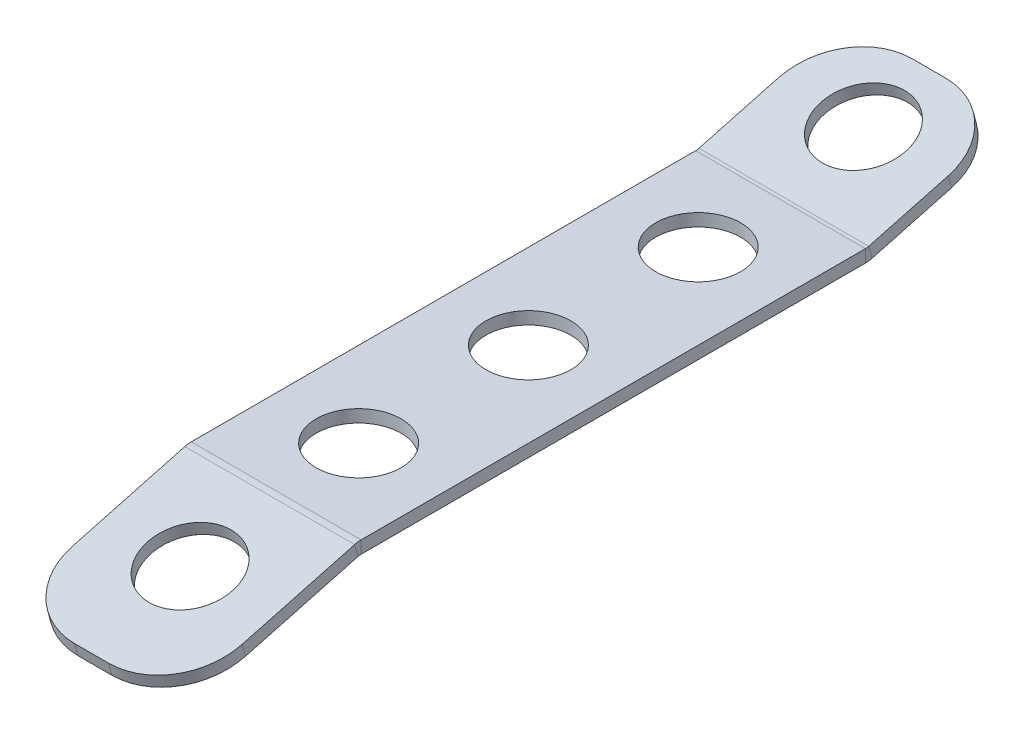
ISO-10303-21;
HEADER;
FILE_DESCRIPTION(('STEP AP214'),'2;1');
FILE_NAME('part.step','',(''),(''),'','','');
FILE_SCHEMA(('AUTOMOTIVE_DESIGN { 1 0 10303 214 1 1 1 1 }'));
ENDSEC;
DATA;
#1=APPLICATION_CONTEXT('core data for automotive mechanical design processes');
#2=APPLICATION_PROTOCOL_DEFINITION('international standard','automotive_design',2000,#1);
#3=PRODUCT_CONTEXT('',#1,'mechanical');
#4=PRODUCT('Part','Part','',(#3));
#5=PRODUCT_RELATED_PRODUCT_CATEGORY('part','',(#4));
#6=PRODUCT_DEFINITION_FORMATION('','',#4);
#7=PRODUCT_DEFINITION_CONTEXT('part definition',#1,'design');
#8=PRODUCT_DEFINITION('design','',#6,#7);
#9=PRODUCT_DEFINITION_SHAPE('','',#8);
#10=(LENGTH_UNIT() NAMED_UNIT(*) SI_UNIT(.MILLI.,.METRE.));
#11=(NAMED_UNIT(*) PLANE_ANGLE_UNIT() SI_UNIT($,.RADIAN.));
#12=(NAMED_UNIT(*) SI_UNIT($,.STERADIAN.) SOLID_ANGLE_UNIT());
#13=UNCERTAINTY_MEASURE_WITH_UNIT(LENGTH_MEASURE(1.E-05),#10,'distance_accuracy_value','');
#14=(GEOMETRIC_REPRESENTATION_CONTEXT(3) GLOBAL_UNCERTAINTY_ASSIGNED_CONTEXT((#13)) GLOBAL_UNIT_ASSIGNED_CONTEXT((#10,
#11,#12)) REPRESENTATION_CONTEXT('',''));
#15=CARTESIAN_POINT('',(0.,0.,0.));
#16=DIRECTION('',(0.,0.,1.));
#17=DIRECTION('',(1.,0.,0.));
#18=AXIS2_PLACEMENT_3D('',#15,#16,#17);
#19=CARTESIAN_POINT('',(0.,0.,0.));
#20=DIRECTION('',(0.,-1.,0.));
#21=DIRECTION('',(0.,0.,-1.));
#22=AXIS2_PLACEMENT_3D('',#19,#20,#21);
#23=PLANE('',#22);
#24=CARTESIAN_POINT('',(0.,0.,9.));
#25=DIRECTION('',(0.,1.,0.));
#26=DIRECTION('',(0.,0.,1.));
#27=AXIS2_PLACEMENT_3D('',#24,#25,#26);
#28=CIRCLE('',#27,2.5);
#29=CARTESIAN_POINT('',(0.,0.,11.5));
#30=VERTEX_POINT('',#29);
#31=EDGE_CURVE('E267',#30,#30,#28,.T.);
#32=ORIENTED_EDGE('',*,*,#31,.F.);
#33=EDGE_LOOP('',(#32));
#34=FACE_BOUND('',#33,.T.);
#35=CARTESIAN_POINT('',(0.,0.,-0.999999999999997));
#36=DIRECTION('',(0.,1.,0.));
#37=DIRECTION('',(0.,0.,1.));
#38=AXIS2_PLACEMENT_3D('',#35,#36,#37);
#39=CIRCLE('',#38,2.5);
#40=CARTESIAN_POINT('',(0.,0.,1.5));
#41=VERTEX_POINT('',#40);
#42=EDGE_CURVE('E270',#41,#41,#39,.T.);
#43=ORIENTED_EDGE('',*,*,#42,.F.);
#44=EDGE_LOOP('',(#43));
#45=FACE_BOUND('',#44,.T.);
#46=CARTESIAN_POINT('',(-1.04744440165294E-13,0.,-11.));
#47=DIRECTION('',(0.,1.,0.));
#48=DIRECTION('',(0.,0.,1.));
#49=AXIS2_PLACEMENT_3D('',#46,#47,#48);
#50=CIRCLE('',#49,2.5);
#51=CARTESIAN_POINT('',(-1.04744440165294E-13,0.,-8.49999999999999));
#52=VERTEX_POINT('',#51);
#53=EDGE_CURVE('E273',#52,#52,#50,.T.);
#54=ORIENTED_EDGE('',*,*,#53,.F.);
#55=EDGE_LOOP('',(#54));
#56=FACE_BOUND('',#55,.T.);
#57=DIRECTION('',(0.,0.,1.));
#58=VECTOR('',#57,1.);
#59=CARTESIAN_POINT('',(-5.,0.,25.));
#60=LINE('',#59,#58);
#61=CARTESIAN_POINT('',(-5.,0.,-15.8553689282104));
#62=VERTEX_POINT('',#61);
#63=CARTESIAN_POINT('',(-5.,0.,13.8553689282104));
#64=VERTEX_POINT('',#63);
#65=EDGE_CURVE('E62',#62,#64,#60,.T.);
#66=ORIENTED_EDGE('',*,*,#65,.T.);
#67=DIRECTION('',(1.,0.,0.));
#68=VECTOR('',#67,1.);
#69=CARTESIAN_POINT('',(0.,0.,13.8553689282104));
#70=LINE('',#69,#68);
#71=CARTESIAN_POINT('',(5.,0.,13.8553689282104));
#72=VERTEX_POINT('',#71);
#73=EDGE_CURVE('E54',#64,#72,#70,.T.);
#74=ORIENTED_EDGE('',*,*,#73,.T.);
#75=DIRECTION('',(0.,0.,-1.));
#76=VECTOR('',#75,1.);
#77=CARTESIAN_POINT('',(5.,0.,25.));
#78=LINE('',#77,#76);
#79=CARTESIAN_POINT('',(5.,0.,-15.8553689282104));
#80=VERTEX_POINT('',#79);
#81=EDGE_CURVE('E70',#72,#80,#78,.T.);
#82=ORIENTED_EDGE('',*,*,#81,.T.);
#83=DIRECTION('',(1.,0.,0.));
#84=VECTOR('',#83,1.);
#85=CARTESIAN_POINT('',(0.,0.,-15.8553689282104));
#86=LINE('',#85,#84);
#87=EDGE_CURVE('E244',#62,#80,#86,.T.);
#88=ORIENTED_EDGE('',*,*,#87,.F.);
#89=EDGE_LOOP('',(#66,#74,#82,#88));
#90=FACE_BOUND('',#89,.T.);
#91=ADVANCED_FACE('F45',(#34,#45,#56,#90),#23,.F.);
#92=CARTESIAN_POINT('',(0.,-4.15343896117762,-0.451498928682303));
#93=DIRECTION('',(0.,-0.965925826289068,-0.258819045102521));
#94=DIRECTION('',(0.,0.258819045102521,-0.965925826289068));
#95=AXIS2_PLACEMENT_3D('',#92,#93,#94);
#96=PLANE('',#95);
#97=CARTESIAN_POINT('',(-1.39162735693614E-13,1.28176098597533,-20.7359412807527));
#98=DIRECTION('',(0.,0.965925826289068,0.258819045102521));
#99=DIRECTION('',(0.,-0.258819045102521,0.965925826289068));
#100=AXIS2_PLACEMENT_3D('',#97,#98,#99);
#101=CIRCLE('',#100,2.5);
#102=CARTESIAN_POINT('',(-1.39221844962675E-13,0.634713373219027,-18.3211267150301));
#103=VERTEX_POINT('',#102);
#104=EDGE_CURVE('E282',#103,#103,#101,.T.);
#105=ORIENTED_EDGE('',*,*,#104,.F.);
#106=EDGE_LOOP('',(#105));
#107=FACE_BOUND('',#106,.T.);
#108=DIRECTION('',(0.,-0.258819045102521,0.965925826289068));
#109=VECTOR('',#108,1.);
#110=CARTESIAN_POINT('',(-5.,-10.6239150887407,23.6966467285444));
#111=LINE('',#110,#109);
#112=CARTESIAN_POINT('',(-5.,1.28176098597533,-20.7359412807527));
#113=VERTEX_POINT('',#112);
#114=CARTESIAN_POINT('',(-5.,0.025099036355474,-16.0460150368329));
#115=VERTEX_POINT('',#114);
#116=EDGE_CURVE('E293',#113,#115,#111,.T.);
#117=ORIENTED_EDGE('',*,*,#116,.T.);
#118=DIRECTION('',(1.,0.,0.));
#119=VECTOR('',#118,1.);
#120=CARTESIAN_POINT('',(0.,0.0250990363554731,-16.0460150368329));
#121=LINE('',#120,#119);
#122=CARTESIAN_POINT('',(5.,0.0250990363554722,-16.0460150368329));
#123=VERTEX_POINT('',#122);
#124=EDGE_CURVE('E319',#115,#123,#121,.T.);
#125=ORIENTED_EDGE('',*,*,#124,.T.);
#126=DIRECTION('',(0.,0.258819045102521,-0.965925826289068));
#127=VECTOR('',#126,1.);
#128=CARTESIAN_POINT('',(5.,-10.6239150887407,23.6966467285444));
#129=LINE('',#128,#127);
#130=CARTESIAN_POINT('',(5.,1.28176098597533,-20.7359412807527));
#131=VERTEX_POINT('',#130);
#132=EDGE_CURVE('E281',#123,#131,#129,.T.);
#133=ORIENTED_EDGE('',*,*,#132,.T.);
#134=CARTESIAN_POINT('',(1.,1.28176098597533,-20.7359412807527));
#135=DIRECTION('',(0.,-0.965925826289068,-0.258819045102521));
#136=DIRECTION('',(0.,0.258819045102521,-0.965925826289068));
#137=AXIS2_PLACEMENT_3D('',#134,#135,#136);
#138=CIRCLE('',#137,4.);
#139=CARTESIAN_POINT('',(1.,2.31703716638542,-24.599644585909));
#140=VERTEX_POINT('',#139);
#141=EDGE_CURVE('E298',#131,#140,#138,.F.);
#142=ORIENTED_EDGE('',*,*,#141,.T.);
#143=DIRECTION('',(-1.,0.,0.));
#144=VECTOR('',#143,1.);
#145=CARTESIAN_POINT('',(-5.,2.31703716638542,-24.599644585909));
#146=LINE('',#145,#144);
#147=CARTESIAN_POINT('',(-0.999999999999999,2.31703716638542,-24.599644585909));
#148=VERTEX_POINT('',#147);
#149=EDGE_CURVE('E290',#140,#148,#146,.T.);
#150=ORIENTED_EDGE('',*,*,#149,.T.);
#151=CARTESIAN_POINT('',(-0.999999999999999,1.28176098597533,-20.7359412807527));
#152=DIRECTION('',(0.,-0.965925826289068,-0.258819045102521));
#153=DIRECTION('',(0.,0.258819045102521,-0.965925826289068));
#154=AXIS2_PLACEMENT_3D('',#151,#152,#153);
#155=CIRCLE('',#154,4.);
#156=EDGE_CURVE('E296',#148,#113,#155,.F.);
#157=ORIENTED_EDGE('',*,*,#156,.T.);
#158=EDGE_LOOP('',(#117,#125,#133,#142,#150,#157));
#159=FACE_BOUND('',#158,.T.);
#160=ADVANCED_FACE('F366',(#107,#159),#96,.F.);
#161=CARTESIAN_POINT('',(5.,-11.3354160523852,23.5060006199219));
#162=DIRECTION('',(1.,0.,0.));
#163=DIRECTION('',(0.,0.258819045102521,-0.965925826289068));
#164=AXIS2_PLACEMENT_3D('',#161,#162,#163);
#165=PLANE('',#164);
#166=DIRECTION('',(0.,0.965925826289068,0.258819045102521));
#167=VECTOR('',#166,1.);
#168=CARTESIAN_POINT('',(5.,-0.686401927289056,-16.2366611454554));
#169=LINE('',#168,#167);
#170=CARTESIAN_POINT('',(5.,-0.686401927289056,-16.2366611454554));
#171=VERTEX_POINT('',#170);
#172=EDGE_CURVE('E316',#171,#123,#169,.T.);
#173=ORIENTED_EDGE('',*,*,#172,.F.);
#174=DIRECTION('',(0.,0.258819045102521,-0.965925826289068));
#175=VECTOR('',#174,1.);
#176=CARTESIAN_POINT('',(5.,-11.3354160523852,23.5060006199219));
#177=LINE('',#176,#175);
#178=CARTESIAN_POINT('',(5.,0.570260022330802,-20.9265873893752));
#179=VERTEX_POINT('',#178);
#180=EDGE_CURVE('E289',#171,#179,#177,.T.);
#181=ORIENTED_EDGE('',*,*,#180,.T.);
#182=DIRECTION('',(0.,0.965925826289068,0.258819045102521));
#183=VECTOR('',#182,1.);
#184=CARTESIAN_POINT('',(5.,0.570260022330802,-20.9265873893752));
#185=LINE('',#184,#183);
#186=EDGE_CURVE('E305',#179,#131,#185,.T.);
#187=ORIENTED_EDGE('',*,*,#186,.T.);
#188=ORIENTED_EDGE('',*,*,#132,.F.);
#189=EDGE_LOOP('',(#173,#181,#187,#188));
#190=FACE_BOUND('',#189,.T.);
#191=ADVANCED_FACE('F386',(#190),#165,.T.);
#192=CARTESIAN_POINT('',(-5.,-11.3354160523852,23.5060006199219));
#193=DIRECTION('',(-1.,0.,0.));
#194=DIRECTION('',(0.,-0.258819045102521,0.965925826289068));
#195=AXIS2_PLACEMENT_3D('',#192,#193,#194);
#196=PLANE('',#195);
#197=DIRECTION('',(0.,-0.965925826289068,-0.258819045102521));
#198=VECTOR('',#197,1.);
#199=CARTESIAN_POINT('',(-5.,-0.686401927289056,-16.2366611454554));
#200=LINE('',#199,#198);
#201=CARTESIAN_POINT('',(-5.,-0.686401927289053,-16.2366611454554));
#202=VERTEX_POINT('',#201);
#203=EDGE_CURVE('E322',#115,#202,#200,.T.);
#204=ORIENTED_EDGE('',*,*,#203,.F.);
#205=ORIENTED_EDGE('',*,*,#116,.F.);
#206=DIRECTION('',(0.,0.965925826289068,0.258819045102521));
#207=VECTOR('',#206,1.);
#208=CARTESIAN_POINT('',(-5.,0.570260022330803,-20.9265873893752));
#209=LINE('',#208,#207);
#210=CARTESIAN_POINT('',(-5.,0.570260022330803,-20.9265873893752));
#211=VERTEX_POINT('',#210);
#212=EDGE_CURVE('E294',#113,#211,#209,.F.);
#213=ORIENTED_EDGE('',*,*,#212,.T.);
#214=DIRECTION('',(0.,-0.258819045102521,0.965925826289068));
#215=VECTOR('',#214,1.);
#216=CARTESIAN_POINT('',(-5.,-11.3354160523852,23.5060006199219));
#217=LINE('',#216,#215);
#218=EDGE_CURVE('E288',#211,#202,#217,.T.);
#219=ORIENTED_EDGE('',*,*,#218,.T.);
#220=EDGE_LOOP('',(#204,#205,#213,#219));
#221=FACE_BOUND('',#220,.T.);
#222=ADVANCED_FACE('F362',(#221),#196,.T.);
#223=CARTESIAN_POINT('',(-5.,1.60553620274089,-24.7902906945315));
#224=DIRECTION('',(0.,0.258819045102521,-0.965925826289068));
#225=DIRECTION('',(-1.,0.,0.));
#226=AXIS2_PLACEMENT_3D('',#223,#224,#225);
#227=PLANE('',#226);
#228=ORIENTED_EDGE('',*,*,#149,.F.);
#229=DIRECTION('',(0.,0.965925826289068,0.258819045102521));
#230=VECTOR('',#229,1.);
#231=CARTESIAN_POINT('',(1.,1.60553620274089,-24.7902906945315));
#232=LINE('',#231,#230);
#233=CARTESIAN_POINT('',(1.,1.60553620274089,-24.7902906945315));
#234=VERTEX_POINT('',#233);
#235=EDGE_CURVE('E311',#140,#234,#232,.F.);
#236=ORIENTED_EDGE('',*,*,#235,.T.);
#237=DIRECTION('',(-1.,0.,0.));
#238=VECTOR('',#237,1.);
#239=CARTESIAN_POINT('',(-5.,1.60553620274089,-24.7902906945315));
#240=LINE('',#239,#238);
#241=CARTESIAN_POINT('',(-0.999999999999999,1.60553620274089,-24.7902906945315));
#242=VERTEX_POINT('',#241);
#243=EDGE_CURVE('E285',#234,#242,#240,.T.);
#244=ORIENTED_EDGE('',*,*,#243,.T.);
#245=DIRECTION('',(0.,0.965925826289068,0.258819045102521));
#246=VECTOR('',#245,1.);
#247=CARTESIAN_POINT('',(-0.999999999999999,1.60553620274089,-24.7902906945315));
#248=LINE('',#247,#246);
#249=EDGE_CURVE('E308',#242,#148,#248,.T.);
#250=ORIENTED_EDGE('',*,*,#249,.T.);
#251=EDGE_LOOP('',(#228,#236,#244,#250));
#252=FACE_BOUND('',#251,.T.);
#253=ADVANCED_FACE('F374',(#252),#227,.T.);
#254=CARTESIAN_POINT('',(0.,-4.86493992482215,-0.64214503730482));
#255=DIRECTION('',(0.,-0.965925826289068,-0.258819045102521));
#256=DIRECTION('',(0.,0.258819045102521,-0.965925826289068));
#257=AXIS2_PLACEMENT_3D('',#254,#255,#256);
#258=PLANE('',#257);
#259=DIRECTION('',(1.,0.,0.));
#260=VECTOR('',#259,1.);
#261=CARTESIAN_POINT('',(0.,-0.686401927289054,-16.2366611454554));
#262=LINE('',#261,#260);
#263=EDGE_CURVE('E313',#202,#171,#262,.T.);
#264=ORIENTED_EDGE('',*,*,#263,.F.);
#265=ORIENTED_EDGE('',*,*,#218,.F.);
#266=CARTESIAN_POINT('',(-0.999999999999999,0.570260022330803,-20.9265873893752));
#267=DIRECTION('',(0.,-0.965925826289068,-0.258819045102521));
#268=DIRECTION('',(0.,0.258819045102521,-0.965925826289068));
#269=AXIS2_PLACEMENT_3D('',#266,#267,#268);
#270=CIRCLE('',#269,4.);
#271=EDGE_CURVE('E300',#211,#242,#270,.T.);
#272=ORIENTED_EDGE('',*,*,#271,.T.);
#273=ORIENTED_EDGE('',*,*,#243,.F.);
#274=CARTESIAN_POINT('',(0.999999999999999,0.570260022330803,-20.9265873893752));
#275=DIRECTION('',(0.,-0.965925826289068,-0.258819045102521));
#276=DIRECTION('',(0.,0.258819045102521,-0.965925826289068));
#277=AXIS2_PLACEMENT_3D('',#274,#275,#276);
#278=CIRCLE('',#277,4.);
#279=EDGE_CURVE('E302',#234,#179,#278,.T.);
#280=ORIENTED_EDGE('',*,*,#279,.T.);
#281=ORIENTED_EDGE('',*,*,#180,.F.);
#282=EDGE_LOOP('',(#264,#265,#272,#273,#280,#281));
#283=FACE_BOUND('',#282,.T.);
#284=CARTESIAN_POINT('',(-1.39295023005706E-13,0.570260022330803,-20.9265873893752));
#285=DIRECTION('',(0.,0.965925826289068,0.258819045102521));
#286=DIRECTION('',(0.,-0.258819045102521,0.965925826289068));
#287=AXIS2_PLACEMENT_3D('',#284,#285,#286);
#288=CIRCLE('',#287,2.5);
#289=CARTESIAN_POINT('',(-1.39354132274767E-13,-0.0767875904255008,-18.5117728236526));
#290=VERTEX_POINT('',#289);
#291=EDGE_CURVE('E278',#290,#290,#288,.T.);
#292=ORIENTED_EDGE('',*,*,#291,.T.);
#293=EDGE_LOOP('',(#292));
#294=FACE_BOUND('',#293,.T.);
#295=ADVANCED_FACE('F379',(#283,#294),#258,.T.);
#296=CARTESIAN_POINT('',(-1.39295023005706E-13,0.570260022330803,-20.9265873893752));
#297=DIRECTION('',(0.,0.965925826289068,0.258819045102521));
#298=DIRECTION('',(0.,-0.258819045102521,0.965925826289068));
#299=AXIS2_PLACEMENT_3D('',#296,#297,#298);
#300=CYLINDRICAL_SURFACE('',#299,2.5);
#301=ORIENTED_EDGE('',*,*,#291,.F.);
#302=EDGE_LOOP('',(#301));
#303=FACE_BOUND('',#302,.T.);
#304=ORIENTED_EDGE('',*,*,#104,.T.);
#305=EDGE_LOOP('',(#304));
#306=FACE_BOUND('',#305,.T.);
#307=ADVANCED_FACE('F424',(#303,#306),#300,.F.);
#308=CARTESIAN_POINT('',(0.999999999999999,0.570260022330803,-20.9265873893752));
#309=DIRECTION('',(0.,0.965925826289068,0.258819045102521));
#310=DIRECTION('',(0.,-0.258819045102521,0.965925826289068));
#311=AXIS2_PLACEMENT_3D('',#308,#309,#310);
#312=CYLINDRICAL_SURFACE('',#311,4.);
#313=ORIENTED_EDGE('',*,*,#279,.F.);
#314=ORIENTED_EDGE('',*,*,#235,.F.);
#315=ORIENTED_EDGE('',*,*,#141,.F.);
#316=ORIENTED_EDGE('',*,*,#186,.F.);
#317=EDGE_LOOP('',(#313,#314,#315,#316));
#318=FACE_BOUND('',#317,.T.);
#319=ADVANCED_FACE('F384',(#318),#312,.T.);
#320=CARTESIAN_POINT('',(-0.999999999999999,0.570260022330803,-20.9265873893752));
#321=DIRECTION('',(0.,0.965925826289068,0.258819045102521));
#322=DIRECTION('',(0.,-0.258819045102521,0.965925826289068));
#323=AXIS2_PLACEMENT_3D('',#320,#321,#322);
#324=CYLINDRICAL_SURFACE('',#323,4.);
#325=ORIENTED_EDGE('',*,*,#271,.F.);
#326=ORIENTED_EDGE('',*,*,#212,.F.);
#327=ORIENTED_EDGE('',*,*,#156,.F.);
#328=ORIENTED_EDGE('',*,*,#249,.F.);
#329=EDGE_LOOP('',(#325,#326,#327,#328));
#330=FACE_BOUND('',#329,.T.);
#331=ADVANCED_FACE('F372',(#330),#324,.T.);
#332=CARTESIAN_POINT('',(-1.04744440165294E-13,-0.7366,-11.));
#333=DIRECTION('',(0.,1.,0.));
#334=DIRECTION('',(0.,0.,1.));
#335=AXIS2_PLACEMENT_3D('',#332,#333,#334);
#336=CYLINDRICAL_SURFACE('',#335,2.5);
#337=CARTESIAN_POINT('',(-1.04744440165294E-13,-0.7366,-11.));
#338=DIRECTION('',(0.,1.,0.));
#339=DIRECTION('',(0.,0.,1.));
#340=AXIS2_PLACEMENT_3D('',#337,#338,#339);
#341=CIRCLE('',#340,2.5);
#342=CARTESIAN_POINT('',(-1.04744440165294E-13,-0.7366,-8.49999999999999));
#343=VERTEX_POINT('',#342);
#344=EDGE_CURVE('E258',#343,#343,#341,.T.);
#345=ORIENTED_EDGE('',*,*,#344,.F.);
#346=EDGE_LOOP('',(#345));
#347=FACE_BOUND('',#346,.T.);
#348=ORIENTED_EDGE('',*,*,#53,.T.);
#349=EDGE_LOOP('',(#348));
#350=FACE_BOUND('',#349,.T.);
#351=ADVANCED_FACE('F417',(#347,#350),#336,.F.);
#352=CARTESIAN_POINT('',(0.,-0.7366,-0.999999999999997));
#353=DIRECTION('',(0.,1.,0.));
#354=DIRECTION('',(0.,0.,1.));
#355=AXIS2_PLACEMENT_3D('',#352,#353,#354);
#356=CYLINDRICAL_SURFACE('',#355,2.5);
#357=CARTESIAN_POINT('',(0.,-0.7366,-0.999999999999997));
#358=DIRECTION('',(0.,1.,0.));
#359=DIRECTION('',(0.,0.,1.));
#360=AXIS2_PLACEMENT_3D('',#357,#358,#359);
#361=CIRCLE('',#360,2.5);
#362=CARTESIAN_POINT('',(0.,-0.7366,1.5));
#363=VERTEX_POINT('',#362);
#364=EDGE_CURVE('E261',#363,#363,#361,.T.);
#365=ORIENTED_EDGE('',*,*,#364,.F.);
#366=EDGE_LOOP('',(#365));
#367=FACE_BOUND('',#366,.T.);
#368=ORIENTED_EDGE('',*,*,#42,.T.);
#369=EDGE_LOOP('',(#368));
#370=FACE_BOUND('',#369,.T.);
#371=ADVANCED_FACE('F411',(#367,#370),#356,.F.);
#372=CARTESIAN_POINT('',(0.,-0.7366,9.));
#373=DIRECTION('',(0.,1.,0.));
#374=DIRECTION('',(0.,0.,1.));
#375=AXIS2_PLACEMENT_3D('',#372,#373,#374);
#376=CYLINDRICAL_SURFACE('',#375,2.5);
#377=CARTESIAN_POINT('',(0.,-0.7366,9.));
#378=DIRECTION('',(0.,1.,0.));
#379=DIRECTION('',(0.,0.,1.));
#380=AXIS2_PLACEMENT_3D('',#377,#378,#379);
#381=CIRCLE('',#380,2.5);
#382=CARTESIAN_POINT('',(0.,-0.7366,11.5));
#383=VERTEX_POINT('',#382);
#384=EDGE_CURVE('E264',#383,#383,#381,.T.);
#385=ORIENTED_EDGE('',*,*,#384,.F.);
#386=EDGE_LOOP('',(#385));
#387=FACE_BOUND('',#386,.T.);
#388=ORIENTED_EDGE('',*,*,#31,.T.);
#389=EDGE_LOOP('',(#388));
#390=FACE_BOUND('',#389,.T.);
#391=ADVANCED_FACE('F407',(#387,#390),#376,.F.);
#392=CARTESIAN_POINT('',(0.,-0.7366,0.));
#393=DIRECTION('',(0.,-1.,0.));
#394=DIRECTION('',(0.,0.,-1.));
#395=AXIS2_PLACEMENT_3D('',#392,#393,#394);
#396=PLANE('',#395);
#397=DIRECTION('',(1.,0.,0.));
#398=VECTOR('',#397,1.);
#399=CARTESIAN_POINT('',(0.,-0.7366,13.8553689282104));
#400=LINE('',#399,#398);
#401=CARTESIAN_POINT('',(-5.,-0.7366,13.8553689282104));
#402=VERTEX_POINT('',#401);
#403=CARTESIAN_POINT('',(5.,-0.7366,13.8553689282104));
#404=VERTEX_POINT('',#403);
#405=EDGE_CURVE('E325',#402,#404,#400,.T.);
#406=ORIENTED_EDGE('',*,*,#405,.F.);
#407=DIRECTION('',(0.,0.,1.));
#408=VECTOR('',#407,1.);
#409=CARTESIAN_POINT('',(-5.,-0.7366,25.));
#410=LINE('',#409,#408);
#411=CARTESIAN_POINT('',(-5.,-0.7366,-15.8553689282104));
#412=VERTEX_POINT('',#411);
#413=EDGE_CURVE('E252',#412,#402,#410,.T.);
#414=ORIENTED_EDGE('',*,*,#413,.F.);
#415=DIRECTION('',(1.,0.,0.));
#416=VECTOR('',#415,1.);
#417=CARTESIAN_POINT('',(0.,-0.7366,-15.8553689282104));
#418=LINE('',#417,#416);
#419=CARTESIAN_POINT('',(5.,-0.7366,-15.8553689282104));
#420=VERTEX_POINT('',#419);
#421=EDGE_CURVE('E255',#412,#420,#418,.T.);
#422=ORIENTED_EDGE('',*,*,#421,.T.);
#423=DIRECTION('',(0.,0.,-1.));
#424=VECTOR('',#423,1.);
#425=CARTESIAN_POINT('',(5.,-0.7366,25.));
#426=LINE('',#425,#424);
#427=EDGE_CURVE('E49',#404,#420,#426,.T.);
#428=ORIENTED_EDGE('',*,*,#427,.F.);
#429=EDGE_LOOP('',(#406,#414,#422,#428));
#430=FACE_BOUND('',#429,.T.);
#431=ORIENTED_EDGE('',*,*,#384,.T.);
#432=EDGE_LOOP('',(#431));
#433=FACE_BOUND('',#432,.T.);
#434=ORIENTED_EDGE('',*,*,#364,.T.);
#435=EDGE_LOOP('',(#434));
#436=FACE_BOUND('',#435,.T.);
#437=ORIENTED_EDGE('',*,*,#344,.T.);
#438=EDGE_LOOP('',(#437));
#439=FACE_BOUND('',#438,.T.);
#440=ADVANCED_FACE('F351',(#430,#433,#436,#439),#396,.T.);
#441=CARTESIAN_POINT('',(5.,-0.7366,25.));
#442=DIRECTION('',(1.,0.,0.));
#443=DIRECTION('',(0.,0.,-1.));
#444=AXIS2_PLACEMENT_3D('',#441,#442,#443);
#445=PLANE('',#444);
#446=DIRECTION('',(0.,1.,0.));
#447=VECTOR('',#446,1.);
#448=CARTESIAN_POINT('',(5.,-0.736599999999999,13.8553689282104));
#449=LINE('',#448,#447);
#450=EDGE_CURVE('E333',#404,#72,#449,.T.);
#451=ORIENTED_EDGE('',*,*,#450,.F.);
#452=ORIENTED_EDGE('',*,*,#427,.T.);
#453=DIRECTION('',(0.,1.,0.));
#454=VECTOR('',#453,1.);
#455=CARTESIAN_POINT('',(5.,-0.736600000000002,-15.8553689282104));
#456=LINE('',#455,#454);
#457=EDGE_CURVE('E253',#420,#80,#456,.T.);
#458=ORIENTED_EDGE('',*,*,#457,.T.);
#459=ORIENTED_EDGE('',*,*,#81,.F.);
#460=EDGE_LOOP('',(#451,#452,#458,#459));
#461=FACE_BOUND('',#460,.T.);
#462=ADVANCED_FACE('F348',(#461),#445,.T.);
#463=CARTESIAN_POINT('',(-5.,-0.7366,25.));
#464=DIRECTION('',(-1.,0.,0.));
#465=DIRECTION('',(0.,0.,1.));
#466=AXIS2_PLACEMENT_3D('',#463,#464,#465);
#467=PLANE('',#466);
#468=DIRECTION('',(0.,-1.,0.));
#469=VECTOR('',#468,1.);
#470=CARTESIAN_POINT('',(-5.,-0.736599999999999,13.8553689282104));
#471=LINE('',#470,#469);
#472=EDGE_CURVE('E12',#64,#402,#471,.T.);
#473=ORIENTED_EDGE('',*,*,#472,.F.);
#474=ORIENTED_EDGE('',*,*,#65,.F.);
#475=DIRECTION('',(0.,-1.,0.));
#476=VECTOR('',#475,1.);
#477=CARTESIAN_POINT('',(-5.,-0.736600000000002,-15.8553689282104));
#478=LINE('',#477,#476);
#479=EDGE_CURVE('E249',#62,#412,#478,.T.);
#480=ORIENTED_EDGE('',*,*,#479,.T.);
#481=ORIENTED_EDGE('',*,*,#413,.T.);
#482=EDGE_LOOP('',(#473,#474,#480,#481));
#483=FACE_BOUND('',#482,.T.);
#484=ADVANCED_FACE('F47',(#483),#467,.T.);
#485=CARTESIAN_POINT('',(-5.,0.7366,-15.8553689282104));
#486=DIRECTION('',(-1.,0.,0.));
#487=DIRECTION('',(0.,0.,1.));
#488=AXIS2_PLACEMENT_3D('',#485,#486,#487);
#489=PLANE('',#488);
#490=ORIENTED_EDGE('',*,*,#479,.F.);
#491=CARTESIAN_POINT('',(-5.,0.7366,-15.8553689282104));
#492=DIRECTION('',(1.,0.,0.));
#493=DIRECTION('',(0.,0.,-1.));
#494=AXIS2_PLACEMENT_3D('',#491,#492,#493);
#495=CIRCLE('',#494,0.7366);
#496=EDGE_CURVE('E233',#62,#115,#495,.T.);
#497=ORIENTED_EDGE('',*,*,#496,.T.);
#498=ORIENTED_EDGE('',*,*,#203,.T.);
#499=CARTESIAN_POINT('',(-5.,0.7366,-15.8553689282104));
#500=DIRECTION('',(1.,0.,0.));
#501=DIRECTION('',(0.,0.,1.));
#502=AXIS2_PLACEMENT_3D('',#499,#500,#501);
#503=CIRCLE('',#502,1.4732);
#504=EDGE_CURVE('E237',#412,#202,#503,.T.);
#505=ORIENTED_EDGE('',*,*,#504,.F.);
#506=EDGE_LOOP('',(#490,#497,#498,#505));
#507=FACE_BOUND('',#506,.T.);
#508=ADVANCED_FACE('F358',(#507),#489,.T.);
#509=CARTESIAN_POINT('',(5.,0.7366,-15.8553689282104));
#510=DIRECTION('',(1.,0.,0.));
#511=DIRECTION('',(0.,0.,-1.));
#512=AXIS2_PLACEMENT_3D('',#509,#510,#511);
#513=PLANE('',#512);
#514=CARTESIAN_POINT('',(5.,0.7366,-15.8553689282104));
#515=DIRECTION('',(1.,0.,0.));
#516=DIRECTION('',(0.,0.,-1.));
#517=AXIS2_PLACEMENT_3D('',#514,#515,#516);
#518=CIRCLE('',#517,0.7366);
#519=EDGE_CURVE('E241',#123,#80,#518,.F.);
#520=ORIENTED_EDGE('',*,*,#519,.T.);
#521=ORIENTED_EDGE('',*,*,#457,.F.);
#522=CARTESIAN_POINT('',(5.,0.7366,-15.8553689282104));
#523=DIRECTION('',(-1.,0.,0.));
#524=DIRECTION('',(0.,0.,-1.));
#525=AXIS2_PLACEMENT_3D('',#522,#523,#524);
#526=CIRCLE('',#525,1.4732);
#527=EDGE_CURVE('E240',#171,#420,#526,.T.);
#528=ORIENTED_EDGE('',*,*,#527,.F.);
#529=ORIENTED_EDGE('',*,*,#172,.T.);
#530=EDGE_LOOP('',(#520,#521,#528,#529));
#531=FACE_BOUND('',#530,.T.);
#532=ADVANCED_FACE('F342',(#531),#513,.T.);
#533=CARTESIAN_POINT('',(-10.031263736325,0.7366,-15.8553689282104));
#534=DIRECTION('',(1.,0.,0.));
#535=DIRECTION('',(0.,0.,-1.));
#536=AXIS2_PLACEMENT_3D('',#533,#534,#535);
#537=CYLINDRICAL_SURFACE('',#536,1.4732);
#538=ORIENTED_EDGE('',*,*,#263,.T.);
#539=ORIENTED_EDGE('',*,*,#527,.T.);
#540=ORIENTED_EDGE('',*,*,#421,.F.);
#541=ORIENTED_EDGE('',*,*,#504,.T.);
#542=EDGE_LOOP('',(#538,#539,#540,#541));
#543=FACE_BOUND('',#542,.T.);
#544=ADVANCED_FACE('F356',(#543),#537,.T.);
#545=CARTESIAN_POINT('',(-10.031263736325,0.7366,-15.8553689282104));
#546=DIRECTION('',(1.,0.,0.));
#547=DIRECTION('',(0.,0.,-1.));
#548=AXIS2_PLACEMENT_3D('',#545,#546,#547);
#549=CYLINDRICAL_SURFACE('',#548,0.7366);
#550=ORIENTED_EDGE('',*,*,#124,.F.);
#551=ORIENTED_EDGE('',*,*,#496,.F.);
#552=ORIENTED_EDGE('',*,*,#87,.T.);
#553=ORIENTED_EDGE('',*,*,#519,.F.);
#554=EDGE_LOOP('',(#550,#551,#552,#553));
#555=FACE_BOUND('',#554,.T.);
#556=ADVANCED_FACE('F347',(#555),#549,.F.);
#557=CARTESIAN_POINT('',(-5.,-1.4732,13.8553689282104));
#558=DIRECTION('',(1.,0.,0.));
#559=DIRECTION('',(0.,0.,-1.));
#560=AXIS2_PLACEMENT_3D('',#557,#558,#559);
#561=PLANE('',#560);
#562=DIRECTION('',(0.,-0.965925826289068,-0.258819045102521));
#563=VECTOR('',#562,1.);
#564=CARTESIAN_POINT('',(-5.,-0.761699036355472,14.0460150368329));
#565=LINE('',#564,#563);
#566=CARTESIAN_POINT('',(-5.,-0.0501980727109449,14.2366611454554));
#567=VERTEX_POINT('',#566);
#568=CARTESIAN_POINT('',(-5.,-0.761699036355473,14.0460150368329));
#569=VERTEX_POINT('',#568);
#570=EDGE_CURVE('E168',#567,#569,#565,.T.);
#571=ORIENTED_EDGE('',*,*,#570,.F.);
#572=CARTESIAN_POINT('',(-5.,-1.4732,13.8553689282104));
#573=DIRECTION('',(-1.,0.,0.));
#574=DIRECTION('',(0.,0.,1.));
#575=AXIS2_PLACEMENT_3D('',#572,#573,#574);
#576=CIRCLE('',#575,1.4732);
#577=EDGE_CURVE('E186',#567,#64,#576,.T.);
#578=ORIENTED_EDGE('',*,*,#577,.T.);
#579=ORIENTED_EDGE('',*,*,#472,.T.);
#580=CARTESIAN_POINT('',(-5.,-1.4732,13.8553689282104));
#581=DIRECTION('',(-1.,0.,0.));
#582=DIRECTION('',(0.,0.,-1.));
#583=AXIS2_PLACEMENT_3D('',#580,#581,#582);
#584=CIRCLE('',#583,0.7366);
#585=EDGE_CURVE('E228',#569,#402,#584,.T.);
#586=ORIENTED_EDGE('',*,*,#585,.F.);
#587=EDGE_LOOP('',(#571,#578,#579,#586));
#588=FACE_BOUND('',#587,.T.);
#589=ADVANCED_FACE('F503',(#588),#561,.F.);
#590=CARTESIAN_POINT('',(5.,-1.4732,13.8553689282104));
#591=DIRECTION('',(-1.,0.,0.));
#592=DIRECTION('',(0.,0.,1.));
#593=AXIS2_PLACEMENT_3D('',#590,#591,#592);
#594=PLANE('',#593);
#595=CARTESIAN_POINT('',(5.,-1.4732,13.8553689282104));
#596=DIRECTION('',(-1.,0.,0.));
#597=DIRECTION('',(0.,0.,1.));
#598=AXIS2_PLACEMENT_3D('',#595,#596,#597);
#599=CIRCLE('',#598,1.4732);
#600=CARTESIAN_POINT('',(5.,-0.0501980727109449,14.2366611454554));
#601=VERTEX_POINT('',#600);
#602=EDGE_CURVE('E189',#72,#601,#599,.F.);
#603=ORIENTED_EDGE('',*,*,#602,.T.);
#604=DIRECTION('',(0.,0.965925826289068,0.258819045102521));
#605=VECTOR('',#604,1.);
#606=CARTESIAN_POINT('',(5.,-0.761699036355472,14.0460150368329));
#607=LINE('',#606,#605);
#608=CARTESIAN_POINT('',(5.,-0.761699036355473,14.0460150368329));
#609=VERTEX_POINT('',#608);
#610=EDGE_CURVE('E205',#609,#601,#607,.T.);
#611=ORIENTED_EDGE('',*,*,#610,.F.);
#612=CARTESIAN_POINT('',(5.,-1.4732,13.8553689282104));
#613=DIRECTION('',(1.,0.,0.));
#614=DIRECTION('',(0.,0.,1.));
#615=AXIS2_PLACEMENT_3D('',#612,#613,#614);
#616=CIRCLE('',#615,0.7366);
#617=EDGE_CURVE('E231',#404,#609,#616,.T.);
#618=ORIENTED_EDGE('',*,*,#617,.F.);
#619=ORIENTED_EDGE('',*,*,#450,.T.);
#620=EDGE_LOOP('',(#603,#611,#618,#619));
#621=FACE_BOUND('',#620,.T.);
#622=ADVANCED_FACE('F539',(#621),#594,.F.);
#623=CARTESIAN_POINT('',(10.031263736325,-1.4732,13.8553689282104));
#624=DIRECTION('',(-1.,0.,0.));
#625=DIRECTION('',(0.,0.,1.));
#626=AXIS2_PLACEMENT_3D('',#623,#624,#625);
#627=CYLINDRICAL_SURFACE('',#626,0.7366);
#628=ORIENTED_EDGE('',*,*,#405,.T.);
#629=ORIENTED_EDGE('',*,*,#617,.T.);
#630=DIRECTION('',(1.,0.,0.));
#631=VECTOR('',#630,1.);
#632=CARTESIAN_POINT('',(0.,-0.761699036355473,14.0460150368329));
#633=LINE('',#632,#631);
#634=EDGE_CURVE('E211',#569,#609,#633,.T.);
#635=ORIENTED_EDGE('',*,*,#634,.F.);
#636=ORIENTED_EDGE('',*,*,#585,.T.);
#637=EDGE_LOOP('',(#628,#629,#635,#636));
#638=FACE_BOUND('',#637,.T.);
#639=ADVANCED_FACE('F550',(#638),#627,.F.);
#640=CARTESIAN_POINT('',(10.031263736325,-1.4732,13.8553689282104));
#641=DIRECTION('',(-1.,0.,0.));
#642=DIRECTION('',(0.,0.,1.));
#643=AXIS2_PLACEMENT_3D('',#640,#641,#642);
#644=CYLINDRICAL_SURFACE('',#643,1.4732);
#645=ORIENTED_EDGE('',*,*,#73,.F.);
#646=ORIENTED_EDGE('',*,*,#577,.F.);
#647=DIRECTION('',(1.,0.,0.));
#648=VECTOR('',#647,1.);
#649=CARTESIAN_POINT('',(0.,-0.0501980727109449,14.2366611454554));
#650=LINE('',#649,#648);
#651=EDGE_CURVE('E225',#567,#601,#650,.T.);
#652=ORIENTED_EDGE('',*,*,#651,.T.);
#653=ORIENTED_EDGE('',*,*,#602,.F.);
#654=EDGE_LOOP('',(#645,#646,#652,#653));
#655=FACE_BOUND('',#654,.T.);
#656=ADVANCED_FACE('F561',(#655),#644,.T.);
#657=CARTESIAN_POINT('',(-0.999999999999999,-2.53599907618037,20.6677929333309));
#658=DIRECTION('',(0.,0.965925826289068,0.258819045102521));
#659=DIRECTION('',(0.,-0.258819045102521,0.965925826289068));
#660=AXIS2_PLACEMENT_3D('',#657,#658,#659);
#661=CYLINDRICAL_SURFACE('',#660,4.);
#662=CARTESIAN_POINT('',(-0.999999999999999,-2.53599907618037,20.6677929333309));
#663=DIRECTION('',(0.,-0.965925826289068,-0.258819045102521));
#664=DIRECTION('',(0.,0.258819045102521,-0.965925826289068));
#665=AXIS2_PLACEMENT_3D('',#662,#663,#664);
#666=CIRCLE('',#665,4.);
#667=CARTESIAN_POINT('',(-0.999999999999999,-3.57127525659046,24.5314962384871));
#668=VERTEX_POINT('',#667);
#669=CARTESIAN_POINT('',(-5.,-2.53599907618037,20.6677929333309));
#670=VERTEX_POINT('',#669);
#671=EDGE_CURVE('E174',#668,#670,#666,.T.);
#672=ORIENTED_EDGE('',*,*,#671,.F.);
#673=DIRECTION('',(0.,0.965925826289068,0.258819045102521));
#674=VECTOR('',#673,1.);
#675=CARTESIAN_POINT('',(-0.999999999999999,-3.57127525659046,24.5314962384871));
#676=LINE('',#675,#674);
#677=CARTESIAN_POINT('',(-0.999999999999999,-2.85977429294593,24.7221423471097));
#678=VERTEX_POINT('',#677);
#679=EDGE_CURVE('E223',#678,#668,#676,.F.);
#680=ORIENTED_EDGE('',*,*,#679,.F.);
#681=CARTESIAN_POINT('',(-0.999999999999999,-1.82449811253585,20.8584390419534));
#682=DIRECTION('',(0.,-0.965925826289068,-0.258819045102521));
#683=DIRECTION('',(0.,0.258819045102521,-0.965925826289068));
#684=AXIS2_PLACEMENT_3D('',#681,#682,#683);
#685=CIRCLE('',#684,4.);
#686=CARTESIAN_POINT('',(-5.,-1.82449811253585,20.8584390419534));
#687=VERTEX_POINT('',#686);
#688=EDGE_CURVE('E185',#687,#678,#685,.F.);
#689=ORIENTED_EDGE('',*,*,#688,.F.);
#690=DIRECTION('',(0.,0.965925826289068,0.258819045102521));
#691=VECTOR('',#690,1.);
#692=CARTESIAN_POINT('',(-5.,-2.53599907618037,20.6677929333309));
#693=LINE('',#692,#691);
#694=EDGE_CURVE('E166',#670,#687,#693,.T.);
#695=ORIENTED_EDGE('',*,*,#694,.F.);
#696=EDGE_LOOP('',(#672,#680,#689,#695));
#697=FACE_BOUND('',#696,.T.);
#698=ADVANCED_FACE('F184',(#697),#661,.T.);
#699=CARTESIAN_POINT('',(-5.,-3.57127525659046,24.5314962384871));
#700=DIRECTION('',(0.,-0.258819045102521,0.965925826289068));
#701=DIRECTION('',(1.,0.,0.));
#702=AXIS2_PLACEMENT_3D('',#699,#700,#701);
#703=PLANE('',#702);
#704=DIRECTION('',(1.,0.,0.));
#705=VECTOR('',#704,1.);
#706=CARTESIAN_POINT('',(-5.,-2.85977429294593,24.7221423471097));
#707=LINE('',#706,#705);
#708=CARTESIAN_POINT('',(0.999999999999999,-2.85977429294593,24.7221423471097));
#709=VERTEX_POINT('',#708);
#710=EDGE_CURVE('E197',#678,#709,#707,.T.);
#711=ORIENTED_EDGE('',*,*,#710,.F.);
#712=ORIENTED_EDGE('',*,*,#679,.T.);
#713=DIRECTION('',(1.,0.,0.));
#714=VECTOR('',#713,1.);
#715=CARTESIAN_POINT('',(-5.,-3.57127525659046,24.5314962384871));
#716=LINE('',#715,#714);
#717=CARTESIAN_POINT('',(0.999999999999999,-3.57127525659046,24.5314962384871));
#718=VERTEX_POINT('',#717);
#719=EDGE_CURVE('E177',#668,#718,#716,.T.);
#720=ORIENTED_EDGE('',*,*,#719,.T.);
#721=DIRECTION('',(0.,0.965925826289068,0.258819045102521));
#722=VECTOR('',#721,1.);
#723=CARTESIAN_POINT('',(0.999999999999999,-3.57127525659046,24.5314962384871));
#724=LINE('',#723,#722);
#725=EDGE_CURVE('E219',#718,#709,#724,.T.);
#726=ORIENTED_EDGE('',*,*,#725,.T.);
#727=EDGE_LOOP('',(#711,#712,#720,#726));
#728=FACE_BOUND('',#727,.T.);
#729=ADVANCED_FACE('F583',(#728),#703,.T.);
#730=CARTESIAN_POINT('',(0.999999999999999,-2.53599907618037,20.6677929333309));
#731=DIRECTION('',(0.,0.965925826289068,0.258819045102521));
#732=DIRECTION('',(0.,-0.258819045102521,0.965925826289068));
#733=AXIS2_PLACEMENT_3D('',#730,#731,#732);
#734=CYLINDRICAL_SURFACE('',#733,4.);
#735=CARTESIAN_POINT('',(0.999999999999999,-2.53599907618037,20.6677929333309));
#736=DIRECTION('',(0.,-0.965925826289068,-0.258819045102521));
#737=DIRECTION('',(0.,0.258819045102521,-0.965925826289068));
#738=AXIS2_PLACEMENT_3D('',#735,#736,#737);
#739=CIRCLE('',#738,4.);
#740=CARTESIAN_POINT('',(5.,-2.53599907618037,20.6677929333309));
#741=VERTEX_POINT('',#740);
#742=EDGE_CURVE('E181',#741,#718,#739,.T.);
#743=ORIENTED_EDGE('',*,*,#742,.F.);
#744=DIRECTION('',(0.,0.965925826289068,0.258819045102521));
#745=VECTOR('',#744,1.);
#746=CARTESIAN_POINT('',(5.,-2.53599907618037,20.6677929333309));
#747=LINE('',#746,#745);
#748=CARTESIAN_POINT('',(5.,-1.82449811253585,20.8584390419534));
#749=VERTEX_POINT('',#748);
#750=EDGE_CURVE('E203',#749,#741,#747,.F.);
#751=ORIENTED_EDGE('',*,*,#750,.F.);
#752=CARTESIAN_POINT('',(0.999999999999999,-1.82449811253585,20.8584390419534));
#753=DIRECTION('',(0.,-0.965925826289068,-0.258819045102521));
#754=DIRECTION('',(0.,0.258819045102521,-0.965925826289068));
#755=AXIS2_PLACEMENT_3D('',#752,#753,#754);
#756=CIRCLE('',#755,4.);
#757=EDGE_CURVE('E195',#709,#749,#756,.F.);
#758=ORIENTED_EDGE('',*,*,#757,.F.);
#759=ORIENTED_EDGE('',*,*,#725,.F.);
#760=EDGE_LOOP('',(#743,#751,#758,#759));
#761=FACE_BOUND('',#760,.T.);
#762=ADVANCED_FACE('F593',(#761),#734,.T.);
#763=CARTESIAN_POINT('',(0.,-2.01836098597533,18.7359412807527));
#764=DIRECTION('',(0.,0.965925826289068,0.258819045102521));
#765=DIRECTION('',(0.,-0.258819045102521,0.965925826289068));
#766=AXIS2_PLACEMENT_3D('',#763,#764,#765);
#767=CYLINDRICAL_SURFACE('',#766,2.5);
#768=CARTESIAN_POINT('',(0.,-2.01836098597533,18.7359412807527));
#769=DIRECTION('',(0.,0.965925826289068,0.258819045102521));
#770=DIRECTION('',(0.,-0.258819045102521,0.965925826289068));
#771=AXIS2_PLACEMENT_3D('',#768,#769,#770);
#772=CIRCLE('',#771,2.5);
#773=CARTESIAN_POINT('',(0.,-2.66540859873163,21.1507558464754));
#774=VERTEX_POINT('',#773);
#775=EDGE_CURVE('E213',#774,#774,#772,.T.);
#776=ORIENTED_EDGE('',*,*,#775,.F.);
#777=EDGE_LOOP('',(#776));
#778=FACE_BOUND('',#777,.T.);
#779=CARTESIAN_POINT('',(0.,-1.3068600223308,18.9265873893753));
#780=DIRECTION('',(0.,0.965925826289068,0.258819045102521));
#781=DIRECTION('',(0.,-0.258819045102521,0.965925826289068));
#782=AXIS2_PLACEMENT_3D('',#779,#780,#781);
#783=CIRCLE('',#782,2.5);
#784=CARTESIAN_POINT('',(0.,-1.95390763508711,21.3414019550979));
#785=VERTEX_POINT('',#784);
#786=EDGE_CURVE('E216',#785,#785,#783,.T.);
#787=ORIENTED_EDGE('',*,*,#786,.T.);
#788=EDGE_LOOP('',(#787));
#789=FACE_BOUND('',#788,.T.);
#790=ADVANCED_FACE('F604',(#778,#789),#767,.F.);
#791=CARTESIAN_POINT('',(0.,2.89920087097258,0.383350581260441));
#792=DIRECTION('',(0.,-0.965925826289068,-0.258819045102521));
#793=DIRECTION('',(0.,0.258819045102521,-0.965925826289068));
#794=AXIS2_PLACEMENT_3D('',#791,#792,#793);
#795=PLANE('',#794);
#796=ORIENTED_EDGE('',*,*,#775,.T.);
#797=EDGE_LOOP('',(#796));
#798=FACE_BOUND('',#797,.T.);
#799=DIRECTION('',(0.,-0.258819045102521,0.965925826289068));
#800=VECTOR('',#799,1.);
#801=CARTESIAN_POINT('',(-5.,-3.57127525659046,24.5314962384871));
#802=LINE('',#801,#800);
#803=EDGE_CURVE('E162',#569,#670,#802,.T.);
#804=ORIENTED_EDGE('',*,*,#803,.F.);
#805=ORIENTED_EDGE('',*,*,#634,.T.);
#806=DIRECTION('',(0.,0.258819045102521,-0.965925826289068));
#807=VECTOR('',#806,1.);
#808=CARTESIAN_POINT('',(5.,-3.57127525659046,24.5314962384871));
#809=LINE('',#808,#807);
#810=EDGE_CURVE('E180',#741,#609,#809,.T.);
#811=ORIENTED_EDGE('',*,*,#810,.F.);
#812=ORIENTED_EDGE('',*,*,#742,.T.);
#813=ORIENTED_EDGE('',*,*,#719,.F.);
#814=ORIENTED_EDGE('',*,*,#671,.T.);
#815=EDGE_LOOP('',(#804,#805,#811,#812,#813,#814));
#816=FACE_BOUND('',#815,.T.);
#817=ADVANCED_FACE('F175',(#798,#816),#795,.T.);
#818=CARTESIAN_POINT('',(5.,-3.57127525659046,24.5314962384871));
#819=DIRECTION('',(1.,0.,0.));
#820=DIRECTION('',(0.,0.258819045102521,-0.965925826289068));
#821=AXIS2_PLACEMENT_3D('',#818,#819,#820);
#822=PLANE('',#821);
#823=ORIENTED_EDGE('',*,*,#810,.T.);
#824=ORIENTED_EDGE('',*,*,#610,.T.);
#825=DIRECTION('',(0.,0.258819045102521,-0.965925826289068));
#826=VECTOR('',#825,1.);
#827=CARTESIAN_POINT('',(5.,-2.85977429294593,24.7221423471097));
#828=LINE('',#827,#826);
#829=EDGE_CURVE('E193',#749,#601,#828,.T.);
#830=ORIENTED_EDGE('',*,*,#829,.F.);
#831=ORIENTED_EDGE('',*,*,#750,.T.);
#832=EDGE_LOOP('',(#823,#824,#830,#831));
#833=FACE_BOUND('',#832,.T.);
#834=ADVANCED_FACE('F625',(#833),#822,.T.);
#835=CARTESIAN_POINT('',(0.,3.6107018346171,0.573996689882958));
#836=DIRECTION('',(0.,-0.965925826289068,-0.258819045102521));
#837=DIRECTION('',(0.,0.258819045102521,-0.965925826289068));
#838=AXIS2_PLACEMENT_3D('',#835,#836,#837);
#839=PLANE('',#838);
#840=ORIENTED_EDGE('',*,*,#651,.F.);
#841=DIRECTION('',(0.,-0.258819045102521,0.965925826289068));
#842=VECTOR('',#841,1.);
#843=CARTESIAN_POINT('',(-5.,-2.85977429294593,24.7221423471097));
#844=LINE('',#843,#842);
#845=EDGE_CURVE('E201',#567,#687,#844,.T.);
#846=ORIENTED_EDGE('',*,*,#845,.T.);
#847=ORIENTED_EDGE('',*,*,#688,.T.);
#848=ORIENTED_EDGE('',*,*,#710,.T.);
#849=ORIENTED_EDGE('',*,*,#757,.T.);
#850=ORIENTED_EDGE('',*,*,#829,.T.);
#851=EDGE_LOOP('',(#840,#846,#847,#848,#849,#850));
#852=FACE_BOUND('',#851,.T.);
#853=ORIENTED_EDGE('',*,*,#786,.F.);
#854=EDGE_LOOP('',(#853));
#855=FACE_BOUND('',#854,.T.);
#856=ADVANCED_FACE('F636',(#852,#855),#839,.F.);
#857=CARTESIAN_POINT('',(-5.,-3.57127525659046,24.5314962384871));
#858=DIRECTION('',(-1.,0.,0.));
#859=DIRECTION('',(0.,-0.258819045102521,0.965925826289068));
#860=AXIS2_PLACEMENT_3D('',#857,#858,#859);
#861=PLANE('',#860);
#862=ORIENTED_EDGE('',*,*,#845,.F.);
#863=ORIENTED_EDGE('',*,*,#570,.T.);
#864=ORIENTED_EDGE('',*,*,#803,.T.);
#865=ORIENTED_EDGE('',*,*,#694,.T.);
#866=EDGE_LOOP('',(#862,#863,#864,#865));
#867=FACE_BOUND('',#866,.T.);
#868=ADVANCED_FACE('F164',(#867),#861,.T.);
#869=CLOSED_SHELL('',(#91,#160,#191,#222,#253,#295,#307,#319,#331,#351,#371,#391,#440,#462,#484,
#508,#532,#544,#556,#589,#622,#639,#656,#698,#729,#762,#790,#817,#834,#856,#868));
#870=MANIFOLD_SOLID_BREP('B2',#869);
#871=ADVANCED_BREP_SHAPE_REPRESENTATION('',(#18,#870),#14);
#872=SHAPE_DEFINITION_REPRESENTATION(#9,#871);
ENDSEC;
END-ISO-10303-21;
